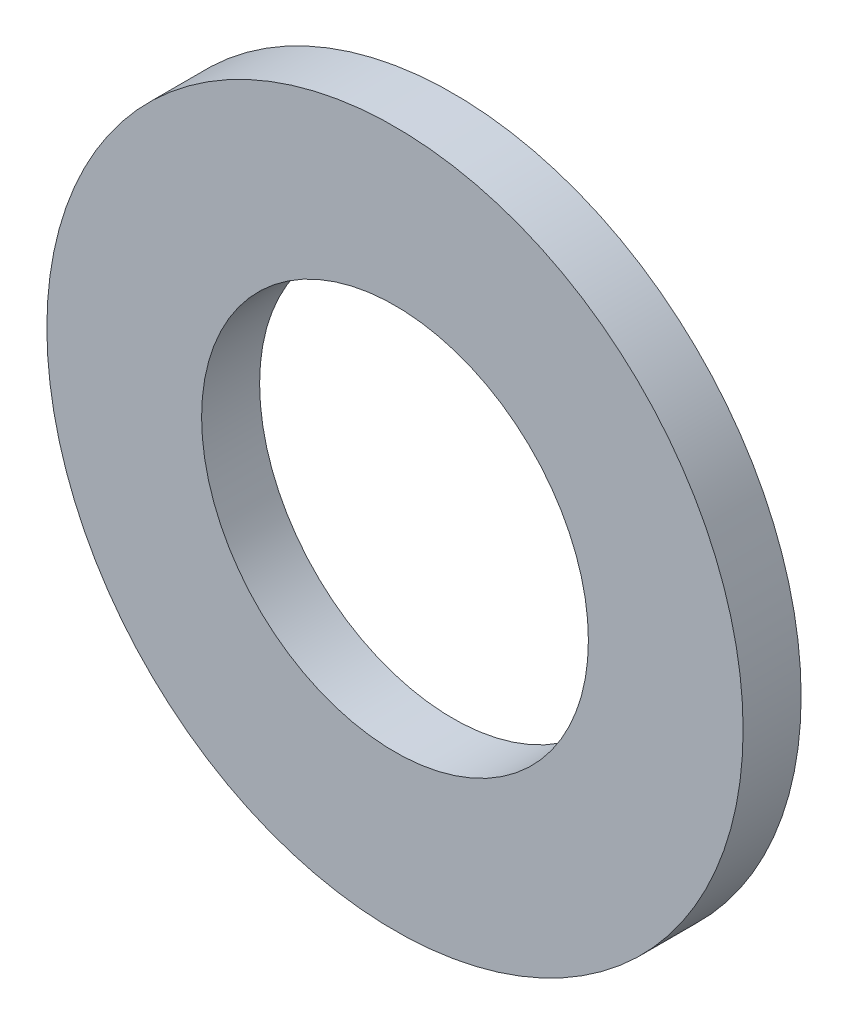
ISO-10303-21;
HEADER;
FILE_DESCRIPTION(('STEP AP214'),'2;1');
FILE_NAME('part.step','',(''),(''),'','','');
FILE_SCHEMA(('AUTOMOTIVE_DESIGN { 1 0 10303 214 1 1 1 1 }'));
ENDSEC;
DATA;
#1=APPLICATION_CONTEXT('core data for automotive mechanical design processes');
#2=APPLICATION_PROTOCOL_DEFINITION('international standard','automotive_design',2000,#1);
#3=PRODUCT_CONTEXT('',#1,'mechanical');
#4=PRODUCT('Part','Part','',(#3));
#5=PRODUCT_RELATED_PRODUCT_CATEGORY('part','',(#4));
#6=PRODUCT_DEFINITION_FORMATION('','',#4);
#7=PRODUCT_DEFINITION_CONTEXT('part definition',#1,'design');
#8=PRODUCT_DEFINITION('design','',#6,#7);
#9=PRODUCT_DEFINITION_SHAPE('','',#8);
#10=(LENGTH_UNIT() NAMED_UNIT(*) SI_UNIT(.MILLI.,.METRE.));
#11=(NAMED_UNIT(*) PLANE_ANGLE_UNIT() SI_UNIT($,.RADIAN.));
#12=(NAMED_UNIT(*) SI_UNIT($,.STERADIAN.) SOLID_ANGLE_UNIT());
#13=UNCERTAINTY_MEASURE_WITH_UNIT(LENGTH_MEASURE(1.E-05),#10,'distance_accuracy_value','');
#14=(GEOMETRIC_REPRESENTATION_CONTEXT(3) GLOBAL_UNCERTAINTY_ASSIGNED_CONTEXT((#13)) GLOBAL_UNIT_ASSIGNED_CONTEXT((#10,
#11,#12)) REPRESENTATION_CONTEXT('',''));
#15=CARTESIAN_POINT('',(0.,0.,0.));
#16=DIRECTION('',(0.,0.,1.));
#17=DIRECTION('',(1.,0.,0.));
#18=AXIS2_PLACEMENT_3D('',#15,#16,#17);
#19=CARTESIAN_POINT('',(0.,0.,-0.749999999999999));
#20=DIRECTION('',(0.,0.,1.));
#21=DIRECTION('',(1.,0.,0.));
#22=AXIS2_PLACEMENT_3D('',#19,#20,#21);
#23=CYLINDRICAL_SURFACE('',#22,9.);
#24=CARTESIAN_POINT('',(0.,0.,-0.749999999999999));
#25=DIRECTION('',(0.,0.,1.));
#26=DIRECTION('',(1.,0.,0.));
#27=AXIS2_PLACEMENT_3D('',#24,#25,#26);
#28=CIRCLE('',#27,9.);
#29=CARTESIAN_POINT('',(9.,0.,-0.749999999999999));
#30=VERTEX_POINT('',#29);
#31=EDGE_CURVE('E10',#30,#30,#28,.T.);
#32=ORIENTED_EDGE('',*,*,#31,.T.);
#33=EDGE_LOOP('',(#32));
#34=FACE_BOUND('',#33,.T.);
#35=CARTESIAN_POINT('',(0.,0.,0.749999999999999));
#36=DIRECTION('',(0.,0.,1.));
#37=DIRECTION('',(1.,0.,0.));
#38=AXIS2_PLACEMENT_3D('',#35,#36,#37);
#39=CIRCLE('',#38,9.);
#40=CARTESIAN_POINT('',(9.,0.,0.749999999999999));
#41=VERTEX_POINT('',#40);
#42=EDGE_CURVE('E45',#41,#41,#39,.T.);
#43=ORIENTED_EDGE('',*,*,#42,.F.);
#44=EDGE_LOOP('',(#43));
#45=FACE_BOUND('',#44,.T.);
#46=ADVANCED_FACE('F35',(#34,#45),#23,.T.);
#47=CARTESIAN_POINT('',(0.,0.,-0.749999999999999));
#48=DIRECTION('',(0.,0.,1.));
#49=DIRECTION('',(1.,0.,0.));
#50=AXIS2_PLACEMENT_3D('',#47,#48,#49);
#51=PLANE('',#50);
#52=CARTESIAN_POINT('',(0.,0.,-0.749999999999999));
#53=DIRECTION('',(0.,0.,1.));
#54=DIRECTION('',(1.,0.,0.));
#55=AXIS2_PLACEMENT_3D('',#52,#53,#54);
#56=CIRCLE('',#55,5.);
#57=CARTESIAN_POINT('',(5.,0.,-0.749999999999999));
#58=VERTEX_POINT('',#57);
#59=EDGE_CURVE('E41',#58,#58,#56,.T.);
#60=ORIENTED_EDGE('',*,*,#59,.T.);
#61=EDGE_LOOP('',(#60));
#62=FACE_BOUND('',#61,.T.);
#63=ORIENTED_EDGE('',*,*,#31,.F.);
#64=EDGE_LOOP('',(#63));
#65=FACE_BOUND('',#64,.T.);
#66=ADVANCED_FACE('F64',(#62,#65),#51,.F.);
#67=CARTESIAN_POINT('',(0.,0.,-0.749999999999999));
#68=DIRECTION('',(0.,0.,1.));
#69=DIRECTION('',(1.,0.,0.));
#70=AXIS2_PLACEMENT_3D('',#67,#68,#69);
#71=CYLINDRICAL_SURFACE('',#70,5.);
#72=ORIENTED_EDGE('',*,*,#59,.F.);
#73=EDGE_LOOP('',(#72));
#74=FACE_BOUND('',#73,.T.);
#75=CARTESIAN_POINT('',(0.,0.,0.749999999999999));
#76=DIRECTION('',(0.,0.,1.));
#77=DIRECTION('',(1.,0.,0.));
#78=AXIS2_PLACEMENT_3D('',#75,#76,#77);
#79=CIRCLE('',#78,5.);
#80=CARTESIAN_POINT('',(5.,0.,0.749999999999999));
#81=VERTEX_POINT('',#80);
#82=EDGE_CURVE('E49',#81,#81,#79,.T.);
#83=ORIENTED_EDGE('',*,*,#82,.T.);
#84=EDGE_LOOP('',(#83));
#85=FACE_BOUND('',#84,.T.);
#86=ADVANCED_FACE('F55',(#74,#85),#71,.F.);
#87=CARTESIAN_POINT('',(0.,0.,0.749999999999999));
#88=DIRECTION('',(0.,0.,1.));
#89=DIRECTION('',(1.,0.,0.));
#90=AXIS2_PLACEMENT_3D('',#87,#88,#89);
#91=PLANE('',#90);
#92=ORIENTED_EDGE('',*,*,#42,.T.);
#93=EDGE_LOOP('',(#92));
#94=FACE_BOUND('',#93,.T.);
#95=ORIENTED_EDGE('',*,*,#82,.F.);
#96=EDGE_LOOP('',(#95));
#97=FACE_BOUND('',#96,.T.);
#98=ADVANCED_FACE('F57',(#94,#97),#91,.T.);
#99=CLOSED_SHELL('',(#46,#66,#86,#98));
#100=MANIFOLD_SOLID_BREP('B2',#99);
#101=ADVANCED_BREP_SHAPE_REPRESENTATION('',(#18,#100),#14);
#102=SHAPE_DEFINITION_REPRESENTATION(#9,#101);
ENDSEC;
END-ISO-10303-21;
